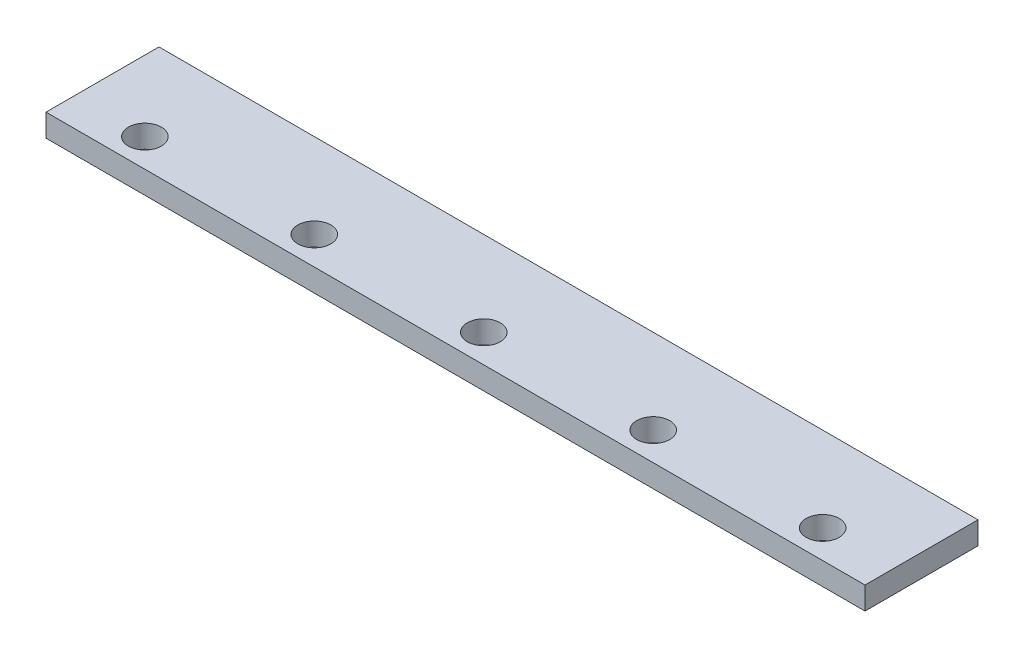
ISO-10303-21;
HEADER;
FILE_DESCRIPTION(('STEP AP214'),'2;1');
FILE_NAME('part.step','',(''),(''),'','','');
FILE_SCHEMA(('AUTOMOTIVE_DESIGN { 1 0 10303 214 1 1 1 1 }'));
ENDSEC;
DATA;
#1=APPLICATION_CONTEXT('core data for automotive mechanical design processes');
#2=APPLICATION_PROTOCOL_DEFINITION('international standard','automotive_design',2000,#1);
#3=PRODUCT_CONTEXT('',#1,'mechanical');
#4=PRODUCT('Part','Part','',(#3));
#5=PRODUCT_RELATED_PRODUCT_CATEGORY('part','',(#4));
#6=PRODUCT_DEFINITION_FORMATION('','',#4);
#7=PRODUCT_DEFINITION_CONTEXT('part definition',#1,'design');
#8=PRODUCT_DEFINITION('design','',#6,#7);
#9=PRODUCT_DEFINITION_SHAPE('','',#8);
#10=(LENGTH_UNIT() NAMED_UNIT(*) SI_UNIT(.MILLI.,.METRE.));
#11=(NAMED_UNIT(*) PLANE_ANGLE_UNIT() SI_UNIT($,.RADIAN.));
#12=(NAMED_UNIT(*) SI_UNIT($,.STERADIAN.) SOLID_ANGLE_UNIT());
#13=UNCERTAINTY_MEASURE_WITH_UNIT(LENGTH_MEASURE(1.E-05),#10,'distance_accuracy_value','');
#14=(GEOMETRIC_REPRESENTATION_CONTEXT(3) GLOBAL_UNCERTAINTY_ASSIGNED_CONTEXT((#13)) GLOBAL_UNIT_ASSIGNED_CONTEXT((#10,
#11,#12)) REPRESENTATION_CONTEXT('',''));
#15=CARTESIAN_POINT('',(0.,0.,0.));
#16=DIRECTION('',(0.,0.,1.));
#17=DIRECTION('',(1.,0.,0.));
#18=AXIS2_PLACEMENT_3D('',#15,#16,#17);
#19=CARTESIAN_POINT('',(0.,16.,0.));
#20=DIRECTION('',(1.,0.,0.));
#21=DIRECTION('',(0.,0.,-1.));
#22=AXIS2_PLACEMENT_3D('',#19,#20,#21);
#23=PLANE('',#22);
#24=DIRECTION('',(0.,0.,1.));
#25=VECTOR('',#24,1.);
#26=CARTESIAN_POINT('',(0.,0.,0.));
#27=LINE('',#26,#25);
#28=CARTESIAN_POINT('',(0.,0.,-80.));
#29=VERTEX_POINT('',#28);
#30=CARTESIAN_POINT('',(0.,0.,0.));
#31=VERTEX_POINT('',#30);
#32=EDGE_CURVE('E96',#29,#31,#27,.T.);
#33=ORIENTED_EDGE('',*,*,#32,.T.);
#34=DIRECTION('',(0.,-1.,0.));
#35=VECTOR('',#34,1.);
#36=CARTESIAN_POINT('',(0.,16.,0.));
#37=LINE('',#36,#35);
#38=CARTESIAN_POINT('',(0.,16.,0.));
#39=VERTEX_POINT('',#38);
#40=EDGE_CURVE('E11',#39,#31,#37,.T.);
#41=ORIENTED_EDGE('',*,*,#40,.F.);
#42=DIRECTION('',(0.,0.,1.));
#43=VECTOR('',#42,1.);
#44=CARTESIAN_POINT('',(0.,16.,0.));
#45=LINE('',#44,#43);
#46=CARTESIAN_POINT('',(0.,16.,-80.));
#47=VERTEX_POINT('',#46);
#48=EDGE_CURVE('E84',#47,#39,#45,.T.);
#49=ORIENTED_EDGE('',*,*,#48,.F.);
#50=DIRECTION('',(0.,-1.,0.));
#51=VECTOR('',#50,1.);
#52=CARTESIAN_POINT('',(0.,16.,-80.));
#53=LINE('',#52,#51);
#54=EDGE_CURVE('E92',#47,#29,#53,.T.);
#55=ORIENTED_EDGE('',*,*,#54,.T.);
#56=EDGE_LOOP('',(#33,#41,#49,#55));
#57=FACE_BOUND('',#56,.T.);
#58=ADVANCED_FACE('F33',(#57),#23,.F.);
#59=CARTESIAN_POINT('',(0.,16.,0.));
#60=DIRECTION('',(0.,0.,-1.));
#61=DIRECTION('',(-1.,0.,0.));
#62=AXIS2_PLACEMENT_3D('',#59,#60,#61);
#63=PLANE('',#62);
#64=DIRECTION('',(1.,0.,0.));
#65=VECTOR('',#64,1.);
#66=CARTESIAN_POINT('',(0.,0.,0.));
#67=LINE('',#66,#65);
#68=CARTESIAN_POINT('',(580.,0.,0.));
#69=VERTEX_POINT('',#68);
#70=EDGE_CURVE('E88',#31,#69,#67,.T.);
#71=ORIENTED_EDGE('',*,*,#70,.T.);
#72=DIRECTION('',(0.,-1.,0.));
#73=VECTOR('',#72,1.);
#74=CARTESIAN_POINT('',(580.,16.,0.));
#75=LINE('',#74,#73);
#76=CARTESIAN_POINT('',(580.,16.,0.));
#77=VERTEX_POINT('',#76);
#78=EDGE_CURVE('E41',#77,#69,#75,.T.);
#79=ORIENTED_EDGE('',*,*,#78,.F.);
#80=DIRECTION('',(1.,0.,0.));
#81=VECTOR('',#80,1.);
#82=CARTESIAN_POINT('',(0.,16.,0.));
#83=LINE('',#82,#81);
#84=EDGE_CURVE('E79',#39,#77,#83,.T.);
#85=ORIENTED_EDGE('',*,*,#84,.F.);
#86=ORIENTED_EDGE('',*,*,#40,.T.);
#87=EDGE_LOOP('',(#71,#79,#85,#86));
#88=FACE_BOUND('',#87,.T.);
#89=ADVANCED_FACE('F87',(#88),#63,.F.);
#90=CARTESIAN_POINT('',(580.,16.,0.));
#91=DIRECTION('',(-1.,0.,0.));
#92=DIRECTION('',(0.,0.,1.));
#93=AXIS2_PLACEMENT_3D('',#90,#91,#92);
#94=PLANE('',#93);
#95=DIRECTION('',(0.,0.,-1.));
#96=VECTOR('',#95,1.);
#97=CARTESIAN_POINT('',(580.,0.,0.));
#98=LINE('',#97,#96);
#99=CARTESIAN_POINT('',(580.,0.,-80.));
#100=VERTEX_POINT('',#99);
#101=EDGE_CURVE('E66',#69,#100,#98,.T.);
#102=ORIENTED_EDGE('',*,*,#101,.T.);
#103=DIRECTION('',(0.,-1.,0.));
#104=VECTOR('',#103,1.);
#105=CARTESIAN_POINT('',(580.,16.,-80.));
#106=LINE('',#105,#104);
#107=CARTESIAN_POINT('',(580.,16.,-80.));
#108=VERTEX_POINT('',#107);
#109=EDGE_CURVE('E89',#108,#100,#106,.T.);
#110=ORIENTED_EDGE('',*,*,#109,.F.);
#111=DIRECTION('',(0.,0.,-1.));
#112=VECTOR('',#111,1.);
#113=CARTESIAN_POINT('',(580.,16.,0.));
#114=LINE('',#113,#112);
#115=EDGE_CURVE('E82',#77,#108,#114,.T.);
#116=ORIENTED_EDGE('',*,*,#115,.F.);
#117=ORIENTED_EDGE('',*,*,#78,.T.);
#118=EDGE_LOOP('',(#102,#110,#116,#117));
#119=FACE_BOUND('',#118,.T.);
#120=ADVANCED_FACE('F90',(#119),#94,.F.);
#121=CARTESIAN_POINT('',(0.,16.,-80.));
#122=DIRECTION('',(0.,0.,1.));
#123=DIRECTION('',(1.,0.,0.));
#124=AXIS2_PLACEMENT_3D('',#121,#122,#123);
#125=PLANE('',#124);
#126=DIRECTION('',(-1.,0.,0.));
#127=VECTOR('',#126,1.);
#128=CARTESIAN_POINT('',(0.,0.,-80.));
#129=LINE('',#128,#127);
#130=EDGE_CURVE('E72',#100,#29,#129,.T.);
#131=ORIENTED_EDGE('',*,*,#130,.T.);
#132=ORIENTED_EDGE('',*,*,#54,.F.);
#133=DIRECTION('',(-1.,0.,0.));
#134=VECTOR('',#133,1.);
#135=CARTESIAN_POINT('',(0.,16.,-80.));
#136=LINE('',#135,#134);
#137=EDGE_CURVE('E49',#108,#47,#136,.T.);
#138=ORIENTED_EDGE('',*,*,#137,.F.);
#139=ORIENTED_EDGE('',*,*,#109,.T.);
#140=EDGE_LOOP('',(#131,#132,#138,#139));
#141=FACE_BOUND('',#140,.T.);
#142=ADVANCED_FACE('F104',(#141),#125,.F.);
#143=CARTESIAN_POINT('',(0.,16.,0.));
#144=DIRECTION('',(0.,-1.,0.));
#145=DIRECTION('',(0.,0.,-1.));
#146=AXIS2_PLACEMENT_3D('',#143,#144,#145);
#147=PLANE('',#146);
#148=CARTESIAN_POINT('',(530.,16.,-20.));
#149=DIRECTION('',(0.,1.,0.));
#150=DIRECTION('',(0.,0.,1.));
#151=AXIS2_PLACEMENT_3D('',#148,#149,#150);
#152=CIRCLE('',#151,11.669157558441);
#153=CARTESIAN_POINT('',(530.,16.,-8.33084244155898));
#154=VERTEX_POINT('',#153);
#155=EDGE_CURVE('E134',#154,#154,#152,.T.);
#156=ORIENTED_EDGE('',*,*,#155,.F.);
#157=EDGE_LOOP('',(#156));
#158=FACE_BOUND('',#157,.T.);
#159=CARTESIAN_POINT('',(410.,16.,-20.));
#160=DIRECTION('',(0.,1.,0.));
#161=DIRECTION('',(0.,0.,1.));
#162=AXIS2_PLACEMENT_3D('',#159,#160,#161);
#163=CIRCLE('',#162,11.669157558441);
#164=CARTESIAN_POINT('',(410.,16.,-8.33084244155898));
#165=VERTEX_POINT('',#164);
#166=EDGE_CURVE('E128',#165,#165,#163,.T.);
#167=ORIENTED_EDGE('',*,*,#166,.F.);
#168=EDGE_LOOP('',(#167));
#169=FACE_BOUND('',#168,.T.);
#170=CARTESIAN_POINT('',(290.,16.,-20.));
#171=DIRECTION('',(0.,1.,0.));
#172=DIRECTION('',(0.,0.,1.));
#173=AXIS2_PLACEMENT_3D('',#170,#171,#172);
#174=CIRCLE('',#173,11.669157558441);
#175=CARTESIAN_POINT('',(290.,16.,-8.33084244155898));
#176=VERTEX_POINT('',#175);
#177=EDGE_CURVE('E122',#176,#176,#174,.T.);
#178=ORIENTED_EDGE('',*,*,#177,.F.);
#179=EDGE_LOOP('',(#178));
#180=FACE_BOUND('',#179,.T.);
#181=CARTESIAN_POINT('',(170.,16.,-20.));
#182=DIRECTION('',(0.,1.,0.));
#183=DIRECTION('',(0.,0.,1.));
#184=AXIS2_PLACEMENT_3D('',#181,#182,#183);
#185=CIRCLE('',#184,11.669157558441);
#186=CARTESIAN_POINT('',(170.,16.,-8.33084244155901));
#187=VERTEX_POINT('',#186);
#188=EDGE_CURVE('E116',#187,#187,#185,.T.);
#189=ORIENTED_EDGE('',*,*,#188,.F.);
#190=EDGE_LOOP('',(#189));
#191=FACE_BOUND('',#190,.T.);
#192=CARTESIAN_POINT('',(50.,16.,-20.));
#193=DIRECTION('',(0.,1.,0.));
#194=DIRECTION('',(0.,0.,1.));
#195=AXIS2_PLACEMENT_3D('',#192,#193,#194);
#196=CIRCLE('',#195,11.669157558441);
#197=CARTESIAN_POINT('',(50.,16.,-8.330842441559));
#198=VERTEX_POINT('',#197);
#199=EDGE_CURVE('E110',#198,#198,#196,.T.);
#200=ORIENTED_EDGE('',*,*,#199,.F.);
#201=EDGE_LOOP('',(#200));
#202=FACE_BOUND('',#201,.T.);
#203=ORIENTED_EDGE('',*,*,#48,.T.);
#204=ORIENTED_EDGE('',*,*,#84,.T.);
#205=ORIENTED_EDGE('',*,*,#115,.T.);
#206=ORIENTED_EDGE('',*,*,#137,.T.);
#207=EDGE_LOOP('',(#203,#204,#205,#206));
#208=FACE_BOUND('',#207,.T.);
#209=ADVANCED_FACE('F80',(#158,#169,#180,#191,#202,#208),#147,.F.);
#210=CARTESIAN_POINT('',(0.,0.,0.));
#211=DIRECTION('',(0.,-1.,0.));
#212=DIRECTION('',(0.,0.,-1.));
#213=AXIS2_PLACEMENT_3D('',#210,#211,#212);
#214=PLANE('',#213);
#215=CARTESIAN_POINT('',(530.,0.,-20.));
#216=DIRECTION('',(0.,1.,0.));
#217=DIRECTION('',(0.,0.,1.));
#218=AXIS2_PLACEMENT_3D('',#215,#216,#217);
#219=CIRCLE('',#218,11.669157558441);
#220=CARTESIAN_POINT('',(530.,0.,-8.33084244155898));
#221=VERTEX_POINT('',#220);
#222=EDGE_CURVE('E131',#221,#221,#219,.T.);
#223=ORIENTED_EDGE('',*,*,#222,.T.);
#224=EDGE_LOOP('',(#223));
#225=FACE_BOUND('',#224,.T.);
#226=CARTESIAN_POINT('',(410.,0.,-20.));
#227=DIRECTION('',(0.,1.,0.));
#228=DIRECTION('',(0.,0.,1.));
#229=AXIS2_PLACEMENT_3D('',#226,#227,#228);
#230=CIRCLE('',#229,11.669157558441);
#231=CARTESIAN_POINT('',(410.,0.,-8.33084244155898));
#232=VERTEX_POINT('',#231);
#233=EDGE_CURVE('E125',#232,#232,#230,.T.);
#234=ORIENTED_EDGE('',*,*,#233,.T.);
#235=EDGE_LOOP('',(#234));
#236=FACE_BOUND('',#235,.T.);
#237=CARTESIAN_POINT('',(290.,0.,-20.));
#238=DIRECTION('',(0.,1.,0.));
#239=DIRECTION('',(0.,0.,1.));
#240=AXIS2_PLACEMENT_3D('',#237,#238,#239);
#241=CIRCLE('',#240,11.669157558441);
#242=CARTESIAN_POINT('',(290.,0.,-8.33084244155898));
#243=VERTEX_POINT('',#242);
#244=EDGE_CURVE('E119',#243,#243,#241,.T.);
#245=ORIENTED_EDGE('',*,*,#244,.T.);
#246=EDGE_LOOP('',(#245));
#247=FACE_BOUND('',#246,.T.);
#248=CARTESIAN_POINT('',(170.,0.,-20.));
#249=DIRECTION('',(0.,1.,0.));
#250=DIRECTION('',(0.,0.,1.));
#251=AXIS2_PLACEMENT_3D('',#248,#249,#250);
#252=CIRCLE('',#251,11.669157558441);
#253=CARTESIAN_POINT('',(170.,0.,-8.33084244155901));
#254=VERTEX_POINT('',#253);
#255=EDGE_CURVE('E113',#254,#254,#252,.T.);
#256=ORIENTED_EDGE('',*,*,#255,.T.);
#257=EDGE_LOOP('',(#256));
#258=FACE_BOUND('',#257,.T.);
#259=CARTESIAN_POINT('',(50.,0.,-20.));
#260=DIRECTION('',(0.,1.,0.));
#261=DIRECTION('',(0.,0.,1.));
#262=AXIS2_PLACEMENT_3D('',#259,#260,#261);
#263=CIRCLE('',#262,11.669157558441);
#264=CARTESIAN_POINT('',(50.,0.,-8.330842441559));
#265=VERTEX_POINT('',#264);
#266=EDGE_CURVE('E99',#265,#265,#263,.T.);
#267=ORIENTED_EDGE('',*,*,#266,.T.);
#268=EDGE_LOOP('',(#267));
#269=FACE_BOUND('',#268,.T.);
#270=ORIENTED_EDGE('',*,*,#32,.F.);
#271=ORIENTED_EDGE('',*,*,#130,.F.);
#272=ORIENTED_EDGE('',*,*,#101,.F.);
#273=ORIENTED_EDGE('',*,*,#70,.F.);
#274=EDGE_LOOP('',(#270,#271,#272,#273));
#275=FACE_BOUND('',#274,.T.);
#276=ADVANCED_FACE('F107',(#225,#236,#247,#258,#269,#275),#214,.T.);
#277=CARTESIAN_POINT('',(50.,0.,-20.));
#278=DIRECTION('',(0.,1.,0.));
#279=DIRECTION('',(0.,0.,1.));
#280=AXIS2_PLACEMENT_3D('',#277,#278,#279);
#281=CYLINDRICAL_SURFACE('',#280,11.669157558441);
#282=ORIENTED_EDGE('',*,*,#266,.F.);
#283=EDGE_LOOP('',(#282));
#284=FACE_BOUND('',#283,.T.);
#285=ORIENTED_EDGE('',*,*,#199,.T.);
#286=EDGE_LOOP('',(#285));
#287=FACE_BOUND('',#286,.T.);
#288=ADVANCED_FACE('F160',(#284,#287),#281,.F.);
#289=CARTESIAN_POINT('',(170.,0.,-20.));
#290=DIRECTION('',(0.,1.,0.));
#291=DIRECTION('',(0.,0.,1.));
#292=AXIS2_PLACEMENT_3D('',#289,#290,#291);
#293=CYLINDRICAL_SURFACE('',#292,11.669157558441);
#294=ORIENTED_EDGE('',*,*,#255,.F.);
#295=EDGE_LOOP('',(#294));
#296=FACE_BOUND('',#295,.T.);
#297=ORIENTED_EDGE('',*,*,#188,.T.);
#298=EDGE_LOOP('',(#297));
#299=FACE_BOUND('',#298,.T.);
#300=ADVANCED_FACE('F162',(#296,#299),#293,.F.);
#301=CARTESIAN_POINT('',(290.,0.,-20.));
#302=DIRECTION('',(0.,1.,0.));
#303=DIRECTION('',(0.,0.,1.));
#304=AXIS2_PLACEMENT_3D('',#301,#302,#303);
#305=CYLINDRICAL_SURFACE('',#304,11.669157558441);
#306=ORIENTED_EDGE('',*,*,#244,.F.);
#307=EDGE_LOOP('',(#306));
#308=FACE_BOUND('',#307,.T.);
#309=ORIENTED_EDGE('',*,*,#177,.T.);
#310=EDGE_LOOP('',(#309));
#311=FACE_BOUND('',#310,.T.);
#312=ADVANCED_FACE('F169',(#308,#311),#305,.F.);
#313=CARTESIAN_POINT('',(410.,0.,-20.));
#314=DIRECTION('',(0.,1.,0.));
#315=DIRECTION('',(0.,0.,1.));
#316=AXIS2_PLACEMENT_3D('',#313,#314,#315);
#317=CYLINDRICAL_SURFACE('',#316,11.669157558441);
#318=ORIENTED_EDGE('',*,*,#233,.F.);
#319=EDGE_LOOP('',(#318));
#320=FACE_BOUND('',#319,.T.);
#321=ORIENTED_EDGE('',*,*,#166,.T.);
#322=EDGE_LOOP('',(#321));
#323=FACE_BOUND('',#322,.T.);
#324=ADVANCED_FACE('F145',(#320,#323),#317,.F.);
#325=CARTESIAN_POINT('',(530.,0.,-20.));
#326=DIRECTION('',(0.,1.,0.));
#327=DIRECTION('',(0.,0.,1.));
#328=AXIS2_PLACEMENT_3D('',#325,#326,#327);
#329=CYLINDRICAL_SURFACE('',#328,11.669157558441);
#330=ORIENTED_EDGE('',*,*,#222,.F.);
#331=EDGE_LOOP('',(#330));
#332=FACE_BOUND('',#331,.T.);
#333=ORIENTED_EDGE('',*,*,#155,.T.);
#334=EDGE_LOOP('',(#333));
#335=FACE_BOUND('',#334,.T.);
#336=ADVANCED_FACE('F142',(#332,#335),#329,.F.);
#337=CLOSED_SHELL('',(#58,#89,#120,#142,#209,#276,#288,#300,#312,#324,#336));
#338=MANIFOLD_SOLID_BREP('B2',#337);
#339=ADVANCED_BREP_SHAPE_REPRESENTATION('',(#18,#338),#14);
#340=SHAPE_DEFINITION_REPRESENTATION(#9,#339);
ENDSEC;
END-ISO-10303-21;
